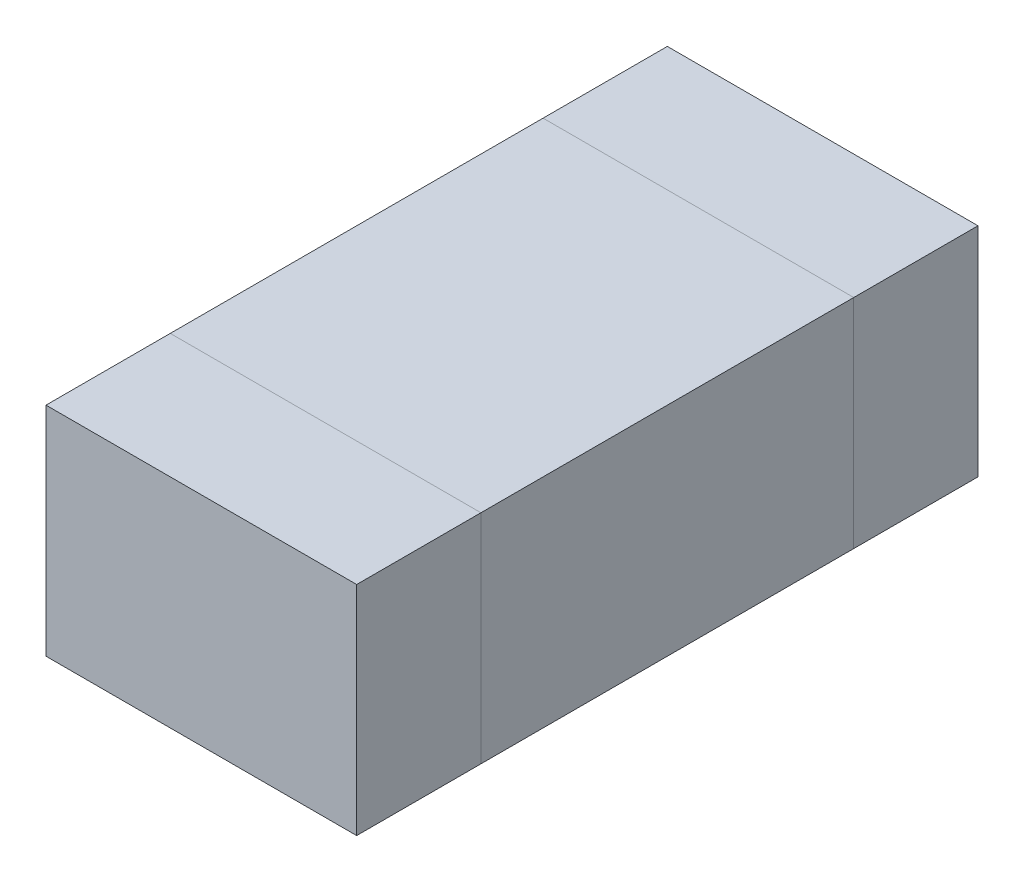
ISO-10303-21;
HEADER;
FILE_DESCRIPTION(('STEP AP214'),'2;1');
FILE_NAME('part.step','',(''),(''),'','','');
FILE_SCHEMA(('AUTOMOTIVE_DESIGN { 1 0 10303 214 1 1 1 1 }'));
ENDSEC;
DATA;
#1=APPLICATION_CONTEXT('core data for automotive mechanical design processes');
#2=APPLICATION_PROTOCOL_DEFINITION('international standard','automotive_design',2000,#1);
#3=PRODUCT_CONTEXT('',#1,'mechanical');
#4=PRODUCT('Part','Part','',(#3));
#5=PRODUCT_RELATED_PRODUCT_CATEGORY('part','',(#4));
#6=PRODUCT_DEFINITION_FORMATION('','',#4);
#7=PRODUCT_DEFINITION_CONTEXT('part definition',#1,'design');
#8=PRODUCT_DEFINITION('design','',#6,#7);
#9=PRODUCT_DEFINITION_SHAPE('','',#8);
#10=(LENGTH_UNIT() NAMED_UNIT(*) SI_UNIT(.MILLI.,.METRE.));
#11=(NAMED_UNIT(*) PLANE_ANGLE_UNIT() SI_UNIT($,.RADIAN.));
#12=(NAMED_UNIT(*) SI_UNIT($,.STERADIAN.) SOLID_ANGLE_UNIT());
#13=UNCERTAINTY_MEASURE_WITH_UNIT(LENGTH_MEASURE(1.E-05),#10,'distance_accuracy_value','');
#14=(GEOMETRIC_REPRESENTATION_CONTEXT(3) GLOBAL_UNCERTAINTY_ASSIGNED_CONTEXT((#13)) GLOBAL_UNIT_ASSIGNED_CONTEXT((#10,
#11,#12)) REPRESENTATION_CONTEXT('',''));
#15=CARTESIAN_POINT('',(0.,0.,0.));
#16=DIRECTION('',(0.,0.,1.));
#17=DIRECTION('',(1.,0.,0.));
#18=AXIS2_PLACEMENT_3D('',#15,#16,#17);
#19=CARTESIAN_POINT('',(0.,0.35,0.));
#20=DIRECTION('',(0.,1.,0.));
#21=DIRECTION('',(0.,0.,1.));
#22=AXIS2_PLACEMENT_3D('',#19,#20,#21);
#23=PLANE('',#22);
#24=DIRECTION('',(0.,0.,-1.));
#25=VECTOR('',#24,1.);
#26=CARTESIAN_POINT('',(-0.25,0.35,-0.3));
#27=LINE('',#26,#25);
#28=CARTESIAN_POINT('',(-0.25,0.35,-0.3));
#29=VERTEX_POINT('',#28);
#30=CARTESIAN_POINT('',(-0.25,0.35,-0.5));
#31=VERTEX_POINT('',#30);
#32=EDGE_CURVE('E58',#29,#31,#27,.T.);
#33=ORIENTED_EDGE('',*,*,#32,.F.);
#34=DIRECTION('',(-1.,0.,0.));
#35=VECTOR('',#34,1.);
#36=CARTESIAN_POINT('',(-0.25,0.35,-0.3));
#37=LINE('',#36,#35);
#38=CARTESIAN_POINT('',(0.25,0.35,-0.3));
#39=VERTEX_POINT('',#38);
#40=EDGE_CURVE('E86',#39,#29,#37,.T.);
#41=ORIENTED_EDGE('',*,*,#40,.F.);
#42=DIRECTION('',(0.,0.,1.));
#43=VECTOR('',#42,1.);
#44=CARTESIAN_POINT('',(0.25,0.35,-0.3));
#45=LINE('',#44,#43);
#46=CARTESIAN_POINT('',(0.25,0.35,-0.5));
#47=VERTEX_POINT('',#46);
#48=EDGE_CURVE('E91',#47,#39,#45,.T.);
#49=ORIENTED_EDGE('',*,*,#48,.F.);
#50=DIRECTION('',(1.,0.,0.));
#51=VECTOR('',#50,1.);
#52=CARTESIAN_POINT('',(-0.25,0.35,-0.5));
#53=LINE('',#52,#51);
#54=EDGE_CURVE('E108',#31,#47,#53,.T.);
#55=ORIENTED_EDGE('',*,*,#54,.F.);
#56=EDGE_LOOP('',(#33,#41,#49,#55));
#57=FACE_BOUND('',#56,.T.);
#58=ADVANCED_FACE('F49',(#57),#23,.T.);
#59=CARTESIAN_POINT('',(0.,0.,0.));
#60=DIRECTION('',(0.,-1.,0.));
#61=DIRECTION('',(0.,0.,-1.));
#62=AXIS2_PLACEMENT_3D('',#59,#60,#61);
#63=PLANE('',#62);
#64=DIRECTION('',(0.,0.,-1.));
#65=VECTOR('',#64,1.);
#66=CARTESIAN_POINT('',(-0.25,0.,-0.3));
#67=LINE('',#66,#65);
#68=CARTESIAN_POINT('',(-0.25,0.,-0.3));
#69=VERTEX_POINT('',#68);
#70=CARTESIAN_POINT('',(-0.25,0.,-0.5));
#71=VERTEX_POINT('',#70);
#72=EDGE_CURVE('E118',#69,#71,#67,.T.);
#73=ORIENTED_EDGE('',*,*,#72,.T.);
#74=DIRECTION('',(1.,0.,0.));
#75=VECTOR('',#74,1.);
#76=CARTESIAN_POINT('',(-0.25,0.,-0.5));
#77=LINE('',#76,#75);
#78=CARTESIAN_POINT('',(0.25,0.,-0.5));
#79=VERTEX_POINT('',#78);
#80=EDGE_CURVE('E106',#71,#79,#77,.T.);
#81=ORIENTED_EDGE('',*,*,#80,.T.);
#82=DIRECTION('',(0.,0.,1.));
#83=VECTOR('',#82,1.);
#84=CARTESIAN_POINT('',(0.25,0.,-0.3));
#85=LINE('',#84,#83);
#86=CARTESIAN_POINT('',(0.25,0.,-0.3));
#87=VERTEX_POINT('',#86);
#88=EDGE_CURVE('E109',#79,#87,#85,.T.);
#89=ORIENTED_EDGE('',*,*,#88,.T.);
#90=DIRECTION('',(-1.,0.,0.));
#91=VECTOR('',#90,1.);
#92=CARTESIAN_POINT('',(-0.25,0.,-0.3));
#93=LINE('',#92,#91);
#94=EDGE_CURVE('E115',#87,#69,#93,.T.);
#95=ORIENTED_EDGE('',*,*,#94,.T.);
#96=EDGE_LOOP('',(#73,#81,#89,#95));
#97=FACE_BOUND('',#96,.T.);
#98=ADVANCED_FACE('F117',(#97),#63,.T.);
#99=CARTESIAN_POINT('',(-0.25,0.888516480713451,-0.5));
#100=DIRECTION('',(0.,0.,-1.));
#101=DIRECTION('',(-1.,0.,0.));
#102=AXIS2_PLACEMENT_3D('',#99,#100,#101);
#103=PLANE('',#102);
#104=DIRECTION('',(0.,-1.,0.));
#105=VECTOR('',#104,1.);
#106=CARTESIAN_POINT('',(-0.25,0.888516480713451,-0.5));
#107=LINE('',#106,#105);
#108=EDGE_CURVE('E12',#31,#71,#107,.T.);
#109=ORIENTED_EDGE('',*,*,#108,.F.);
#110=ORIENTED_EDGE('',*,*,#54,.T.);
#111=DIRECTION('',(0.,-1.,0.));
#112=VECTOR('',#111,1.);
#113=CARTESIAN_POINT('',(0.25,0.888516480713451,-0.5));
#114=LINE('',#113,#112);
#115=EDGE_CURVE('E103',#47,#79,#114,.T.);
#116=ORIENTED_EDGE('',*,*,#115,.T.);
#117=ORIENTED_EDGE('',*,*,#80,.F.);
#118=EDGE_LOOP('',(#109,#110,#116,#117));
#119=FACE_BOUND('',#118,.T.);
#120=ADVANCED_FACE('F104',(#119),#103,.T.);
#121=CARTESIAN_POINT('',(0.25,0.888516480713451,-0.3));
#122=DIRECTION('',(1.,0.,0.));
#123=DIRECTION('',(0.,0.,-1.));
#124=AXIS2_PLACEMENT_3D('',#121,#122,#123);
#125=PLANE('',#124);
#126=ORIENTED_EDGE('',*,*,#115,.F.);
#127=ORIENTED_EDGE('',*,*,#48,.T.);
#128=DIRECTION('',(0.,-1.,0.));
#129=VECTOR('',#128,1.);
#130=CARTESIAN_POINT('',(0.25,0.888516480713451,-0.3));
#131=LINE('',#130,#129);
#132=EDGE_CURVE('E98',#39,#87,#131,.T.);
#133=ORIENTED_EDGE('',*,*,#132,.T.);
#134=ORIENTED_EDGE('',*,*,#88,.F.);
#135=EDGE_LOOP('',(#126,#127,#133,#134));
#136=FACE_BOUND('',#135,.T.);
#137=ADVANCED_FACE('F110',(#136),#125,.T.);
#138=CARTESIAN_POINT('',(-0.25,0.888516480713451,-0.3));
#139=DIRECTION('',(0.,0.,1.));
#140=DIRECTION('',(1.,0.,0.));
#141=AXIS2_PLACEMENT_3D('',#138,#139,#140);
#142=PLANE('',#141);
#143=ORIENTED_EDGE('',*,*,#132,.F.);
#144=ORIENTED_EDGE('',*,*,#40,.T.);
#145=DIRECTION('',(0.,-1.,0.));
#146=VECTOR('',#145,1.);
#147=CARTESIAN_POINT('',(-0.25,0.888516480713451,-0.3));
#148=LINE('',#147,#146);
#149=EDGE_CURVE('E130',#29,#69,#148,.T.);
#150=ORIENTED_EDGE('',*,*,#149,.T.);
#151=ORIENTED_EDGE('',*,*,#94,.F.);
#152=EDGE_LOOP('',(#143,#144,#150,#151));
#153=FACE_BOUND('',#152,.T.);
#154=ADVANCED_FACE('F139',(#153),#142,.T.);
#155=CARTESIAN_POINT('',(-0.25,0.888516480713451,-0.3));
#156=DIRECTION('',(-1.,0.,0.));
#157=DIRECTION('',(0.,0.,1.));
#158=AXIS2_PLACEMENT_3D('',#155,#156,#157);
#159=PLANE('',#158);
#160=ORIENTED_EDGE('',*,*,#149,.F.);
#161=ORIENTED_EDGE('',*,*,#32,.T.);
#162=ORIENTED_EDGE('',*,*,#108,.T.);
#163=ORIENTED_EDGE('',*,*,#72,.F.);
#164=EDGE_LOOP('',(#160,#161,#162,#163));
#165=FACE_BOUND('',#164,.T.);
#166=ADVANCED_FACE('F141',(#165),#159,.T.);
#167=CLOSED_SHELL('',(#58,#98,#120,#137,#154,#166));
#168=MANIFOLD_SOLID_BREP('B2',#167);
#169=CARTESIAN_POINT('',(0.,0.35,0.));
#170=DIRECTION('',(0.,1.,0.));
#171=DIRECTION('',(0.,0.,1.));
#172=AXIS2_PLACEMENT_3D('',#169,#170,#171);
#173=PLANE('',#172);
#174=DIRECTION('',(0.,0.,-1.));
#175=VECTOR('',#174,1.);
#176=CARTESIAN_POINT('',(-0.25,0.35,0.3));
#177=LINE('',#176,#175);
#178=CARTESIAN_POINT('',(-0.25,0.35,0.5));
#179=VERTEX_POINT('',#178);
#180=CARTESIAN_POINT('',(-0.25,0.35,0.3));
#181=VERTEX_POINT('',#180);
#182=EDGE_CURVE('E209',#179,#181,#177,.T.);
#183=ORIENTED_EDGE('',*,*,#182,.F.);
#184=DIRECTION('',(-1.,0.,0.));
#185=VECTOR('',#184,1.);
#186=CARTESIAN_POINT('',(-0.25,0.35,0.5));
#187=LINE('',#186,#185);
#188=CARTESIAN_POINT('',(0.25,0.35,0.5));
#189=VERTEX_POINT('',#188);
#190=EDGE_CURVE('E232',#189,#179,#187,.T.);
#191=ORIENTED_EDGE('',*,*,#190,.F.);
#192=DIRECTION('',(0.,0.,1.));
#193=VECTOR('',#192,1.);
#194=CARTESIAN_POINT('',(0.25,0.35,0.3));
#195=LINE('',#194,#193);
#196=CARTESIAN_POINT('',(0.25,0.35,0.3));
#197=VERTEX_POINT('',#196);
#198=EDGE_CURVE('E237',#197,#189,#195,.T.);
#199=ORIENTED_EDGE('',*,*,#198,.F.);
#200=DIRECTION('',(1.,0.,0.));
#201=VECTOR('',#200,1.);
#202=CARTESIAN_POINT('',(-0.25,0.35,0.3));
#203=LINE('',#202,#201);
#204=EDGE_CURVE('E252',#181,#197,#203,.T.);
#205=ORIENTED_EDGE('',*,*,#204,.F.);
#206=EDGE_LOOP('',(#183,#191,#199,#205));
#207=FACE_BOUND('',#206,.T.);
#208=ADVANCED_FACE('F201',(#207),#173,.T.);
#209=CARTESIAN_POINT('',(0.,0.,0.));
#210=DIRECTION('',(0.,1.,0.));
#211=DIRECTION('',(0.,0.,1.));
#212=AXIS2_PLACEMENT_3D('',#209,#210,#211);
#213=PLANE('',#212);
#214=DIRECTION('',(0.,0.,-1.));
#215=VECTOR('',#214,1.);
#216=CARTESIAN_POINT('',(-0.25,0.,0.3));
#217=LINE('',#216,#215);
#218=CARTESIAN_POINT('',(-0.25,0.,0.5));
#219=VERTEX_POINT('',#218);
#220=CARTESIAN_POINT('',(-0.25,0.,0.3));
#221=VERTEX_POINT('',#220);
#222=EDGE_CURVE('E261',#219,#221,#217,.T.);
#223=ORIENTED_EDGE('',*,*,#222,.T.);
#224=DIRECTION('',(1.,0.,0.));
#225=VECTOR('',#224,1.);
#226=CARTESIAN_POINT('',(-0.25,0.,0.3));
#227=LINE('',#226,#225);
#228=CARTESIAN_POINT('',(0.25,0.,0.3));
#229=VERTEX_POINT('',#228);
#230=EDGE_CURVE('E250',#221,#229,#227,.T.);
#231=ORIENTED_EDGE('',*,*,#230,.T.);
#232=DIRECTION('',(0.,0.,1.));
#233=VECTOR('',#232,1.);
#234=CARTESIAN_POINT('',(0.25,0.,0.3));
#235=LINE('',#234,#233);
#236=CARTESIAN_POINT('',(0.25,0.,0.5));
#237=VERTEX_POINT('',#236);
#238=EDGE_CURVE('E253',#229,#237,#235,.T.);
#239=ORIENTED_EDGE('',*,*,#238,.T.);
#240=DIRECTION('',(-1.,0.,0.));
#241=VECTOR('',#240,1.);
#242=CARTESIAN_POINT('',(-0.25,0.,0.5));
#243=LINE('',#242,#241);
#244=EDGE_CURVE('E258',#237,#219,#243,.T.);
#245=ORIENTED_EDGE('',*,*,#244,.T.);
#246=EDGE_LOOP('',(#223,#231,#239,#245));
#247=FACE_BOUND('',#246,.T.);
#248=ADVANCED_FACE('F260',(#247),#213,.F.);
#249=CARTESIAN_POINT('',(-0.25,0.88851648071345,0.3));
#250=DIRECTION('',(0.,0.,-1.));
#251=DIRECTION('',(-1.,0.,0.));
#252=AXIS2_PLACEMENT_3D('',#249,#250,#251);
#253=PLANE('',#252);
#254=DIRECTION('',(0.,-1.,0.));
#255=VECTOR('',#254,1.);
#256=CARTESIAN_POINT('',(-0.25,0.88851648071345,0.3));
#257=LINE('',#256,#255);
#258=EDGE_CURVE('E47',#181,#221,#257,.T.);
#259=ORIENTED_EDGE('',*,*,#258,.F.);
#260=ORIENTED_EDGE('',*,*,#204,.T.);
#261=DIRECTION('',(0.,-1.,0.));
#262=VECTOR('',#261,1.);
#263=CARTESIAN_POINT('',(0.25,0.88851648071345,0.3));
#264=LINE('',#263,#262);
#265=EDGE_CURVE('E247',#197,#229,#264,.T.);
#266=ORIENTED_EDGE('',*,*,#265,.T.);
#267=ORIENTED_EDGE('',*,*,#230,.F.);
#268=EDGE_LOOP('',(#259,#260,#266,#267));
#269=FACE_BOUND('',#268,.T.);
#270=ADVANCED_FACE('F248',(#269),#253,.T.);
#271=CARTESIAN_POINT('',(0.25,0.88851648071345,0.3));
#272=DIRECTION('',(1.,0.,0.));
#273=DIRECTION('',(0.,0.,-1.));
#274=AXIS2_PLACEMENT_3D('',#271,#272,#273);
#275=PLANE('',#274);
#276=ORIENTED_EDGE('',*,*,#265,.F.);
#277=ORIENTED_EDGE('',*,*,#198,.T.);
#278=DIRECTION('',(0.,-1.,0.));
#279=VECTOR('',#278,1.);
#280=CARTESIAN_POINT('',(0.25,0.88851648071345,0.5));
#281=LINE('',#280,#279);
#282=EDGE_CURVE('E242',#189,#237,#281,.T.);
#283=ORIENTED_EDGE('',*,*,#282,.T.);
#284=ORIENTED_EDGE('',*,*,#238,.F.);
#285=EDGE_LOOP('',(#276,#277,#283,#284));
#286=FACE_BOUND('',#285,.T.);
#287=ADVANCED_FACE('F254',(#286),#275,.T.);
#288=CARTESIAN_POINT('',(-0.25,0.88851648071345,0.5));
#289=DIRECTION('',(0.,0.,1.));
#290=DIRECTION('',(1.,0.,0.));
#291=AXIS2_PLACEMENT_3D('',#288,#289,#290);
#292=PLANE('',#291);
#293=ORIENTED_EDGE('',*,*,#282,.F.);
#294=ORIENTED_EDGE('',*,*,#190,.T.);
#295=DIRECTION('',(0.,-1.,0.));
#296=VECTOR('',#295,1.);
#297=CARTESIAN_POINT('',(-0.25,0.88851648071345,0.5));
#298=LINE('',#297,#296);
#299=EDGE_CURVE('E268',#179,#219,#298,.T.);
#300=ORIENTED_EDGE('',*,*,#299,.T.);
#301=ORIENTED_EDGE('',*,*,#244,.F.);
#302=EDGE_LOOP('',(#293,#294,#300,#301));
#303=FACE_BOUND('',#302,.T.);
#304=ADVANCED_FACE('F274',(#303),#292,.T.);
#305=CARTESIAN_POINT('',(-0.25,0.88851648071345,0.3));
#306=DIRECTION('',(-1.,0.,0.));
#307=DIRECTION('',(0.,0.,1.));
#308=AXIS2_PLACEMENT_3D('',#305,#306,#307);
#309=PLANE('',#308);
#310=ORIENTED_EDGE('',*,*,#299,.F.);
#311=ORIENTED_EDGE('',*,*,#182,.T.);
#312=ORIENTED_EDGE('',*,*,#258,.T.);
#313=ORIENTED_EDGE('',*,*,#222,.F.);
#314=EDGE_LOOP('',(#310,#311,#312,#313));
#315=FACE_BOUND('',#314,.T.);
#316=ADVANCED_FACE('F275',(#315),#309,.T.);
#317=CLOSED_SHELL('',(#208,#248,#270,#287,#304,#316));
#318=MANIFOLD_SOLID_BREP('B6',#317);
#319=CARTESIAN_POINT('',(0.25,0.35,-0.3));
#320=DIRECTION('',(-1.,0.,0.));
#321=DIRECTION('',(0.,0.,1.));
#322=AXIS2_PLACEMENT_3D('',#319,#320,#321);
#323=PLANE('',#322);
#324=DIRECTION('',(0.,0.,-1.));
#325=VECTOR('',#324,1.);
#326=CARTESIAN_POINT('',(0.25,0.,-0.3));
#327=LINE('',#326,#325);
#328=CARTESIAN_POINT('',(0.25,0.,0.3));
#329=VERTEX_POINT('',#328);
#330=CARTESIAN_POINT('',(0.25,0.,-0.3));
#331=VERTEX_POINT('',#330);
#332=EDGE_CURVE('E401',#329,#331,#327,.T.);
#333=ORIENTED_EDGE('',*,*,#332,.T.);
#334=DIRECTION('',(0.,-1.,0.));
#335=VECTOR('',#334,1.);
#336=CARTESIAN_POINT('',(0.25,0.35,-0.3));
#337=LINE('',#336,#335);
#338=CARTESIAN_POINT('',(0.25,0.35,-0.3));
#339=VERTEX_POINT('',#338);
#340=EDGE_CURVE('E199',#339,#331,#337,.T.);
#341=ORIENTED_EDGE('',*,*,#340,.F.);
#342=DIRECTION('',(0.,0.,-1.));
#343=VECTOR('',#342,1.);
#344=CARTESIAN_POINT('',(0.25,0.35,-0.3));
#345=LINE('',#344,#343);
#346=CARTESIAN_POINT('',(0.25,0.35,0.3));
#347=VERTEX_POINT('',#346);
#348=EDGE_CURVE('E384',#347,#339,#345,.T.);
#349=ORIENTED_EDGE('',*,*,#348,.F.);
#350=DIRECTION('',(0.,-1.,0.));
#351=VECTOR('',#350,1.);
#352=CARTESIAN_POINT('',(0.25,0.35,0.3));
#353=LINE('',#352,#351);
#354=EDGE_CURVE('E397',#347,#329,#353,.T.);
#355=ORIENTED_EDGE('',*,*,#354,.T.);
#356=EDGE_LOOP('',(#333,#341,#349,#355));
#357=FACE_BOUND('',#356,.T.);
#358=ADVANCED_FACE('F324',(#357),#323,.F.);
#359=CARTESIAN_POINT('',(-0.25,0.35,-0.3));
#360=DIRECTION('',(0.,0.,1.));
#361=DIRECTION('',(1.,0.,0.));
#362=AXIS2_PLACEMENT_3D('',#359,#360,#361);
#363=PLANE('',#362);
#364=DIRECTION('',(-1.,0.,0.));
#365=VECTOR('',#364,1.);
#366=CARTESIAN_POINT('',(-0.25,0.,-0.3));
#367=LINE('',#366,#365);
#368=CARTESIAN_POINT('',(-0.25,0.,-0.3));
#369=VERTEX_POINT('',#368);
#370=EDGE_CURVE('E389',#331,#369,#367,.T.);
#371=ORIENTED_EDGE('',*,*,#370,.T.);
#372=DIRECTION('',(0.,-1.,0.));
#373=VECTOR('',#372,1.);
#374=CARTESIAN_POINT('',(-0.25,0.35,-0.3));
#375=LINE('',#374,#373);
#376=CARTESIAN_POINT('',(-0.25,0.35,-0.3));
#377=VERTEX_POINT('',#376);
#378=EDGE_CURVE('E333',#377,#369,#375,.T.);
#379=ORIENTED_EDGE('',*,*,#378,.F.);
#380=DIRECTION('',(-1.,0.,0.));
#381=VECTOR('',#380,1.);
#382=CARTESIAN_POINT('',(-0.25,0.35,-0.3));
#383=LINE('',#382,#381);
#384=EDGE_CURVE('E379',#339,#377,#383,.T.);
#385=ORIENTED_EDGE('',*,*,#384,.F.);
#386=ORIENTED_EDGE('',*,*,#340,.T.);
#387=EDGE_LOOP('',(#371,#379,#385,#386));
#388=FACE_BOUND('',#387,.T.);
#389=ADVANCED_FACE('F388',(#388),#363,.F.);
#390=CARTESIAN_POINT('',(-0.25,0.35,-0.3));
#391=DIRECTION('',(1.,0.,0.));
#392=DIRECTION('',(0.,0.,-1.));
#393=AXIS2_PLACEMENT_3D('',#390,#391,#392);
#394=PLANE('',#393);
#395=DIRECTION('',(0.,0.,1.));
#396=VECTOR('',#395,1.);
#397=CARTESIAN_POINT('',(-0.25,0.,-0.3));
#398=LINE('',#397,#396);
#399=CARTESIAN_POINT('',(-0.25,0.,0.3));
#400=VERTEX_POINT('',#399);
#401=EDGE_CURVE('E364',#369,#400,#398,.T.);
#402=ORIENTED_EDGE('',*,*,#401,.T.);
#403=DIRECTION('',(0.,-1.,0.));
#404=VECTOR('',#403,1.);
#405=CARTESIAN_POINT('',(-0.25,0.35,0.3));
#406=LINE('',#405,#404);
#407=CARTESIAN_POINT('',(-0.25,0.35,0.3));
#408=VERTEX_POINT('',#407);
#409=EDGE_CURVE('E391',#408,#400,#406,.T.);
#410=ORIENTED_EDGE('',*,*,#409,.F.);
#411=DIRECTION('',(0.,0.,1.));
#412=VECTOR('',#411,1.);
#413=CARTESIAN_POINT('',(-0.25,0.35,-0.3));
#414=LINE('',#413,#412);
#415=EDGE_CURVE('E382',#377,#408,#414,.T.);
#416=ORIENTED_EDGE('',*,*,#415,.F.);
#417=ORIENTED_EDGE('',*,*,#378,.T.);
#418=EDGE_LOOP('',(#402,#410,#416,#417));
#419=FACE_BOUND('',#418,.T.);
#420=ADVANCED_FACE('F392',(#419),#394,.F.);
#421=CARTESIAN_POINT('',(-0.25,0.35,0.3));
#422=DIRECTION('',(0.,0.,-1.));
#423=DIRECTION('',(-1.,0.,0.));
#424=AXIS2_PLACEMENT_3D('',#421,#422,#423);
#425=PLANE('',#424);
#426=DIRECTION('',(1.,0.,0.));
#427=VECTOR('',#426,1.);
#428=CARTESIAN_POINT('',(-0.25,0.,0.3));
#429=LINE('',#428,#427);
#430=EDGE_CURVE('E372',#400,#329,#429,.T.);
#431=ORIENTED_EDGE('',*,*,#430,.T.);
#432=ORIENTED_EDGE('',*,*,#354,.F.);
#433=DIRECTION('',(1.,0.,0.));
#434=VECTOR('',#433,1.);
#435=CARTESIAN_POINT('',(-0.25,0.35,0.3));
#436=LINE('',#435,#434);
#437=EDGE_CURVE('E343',#408,#347,#436,.T.);
#438=ORIENTED_EDGE('',*,*,#437,.F.);
#439=ORIENTED_EDGE('',*,*,#409,.T.);
#440=EDGE_LOOP('',(#431,#432,#438,#439));
#441=FACE_BOUND('',#440,.T.);
#442=ADVANCED_FACE('F413',(#441),#425,.F.);
#443=CARTESIAN_POINT('',(0.,0.35,0.));
#444=DIRECTION('',(0.,1.,0.));
#445=DIRECTION('',(0.,0.,1.));
#446=AXIS2_PLACEMENT_3D('',#443,#444,#445);
#447=PLANE('',#446);
#448=ORIENTED_EDGE('',*,*,#348,.T.);
#449=ORIENTED_EDGE('',*,*,#384,.T.);
#450=ORIENTED_EDGE('',*,*,#415,.T.);
#451=ORIENTED_EDGE('',*,*,#437,.T.);
#452=EDGE_LOOP('',(#448,#449,#450,#451));
#453=FACE_BOUND('',#452,.T.);
#454=ADVANCED_FACE('F380',(#453),#447,.T.);
#455=CARTESIAN_POINT('',(0.,0.,0.));
#456=DIRECTION('',(0.,1.,0.));
#457=DIRECTION('',(0.,0.,1.));
#458=AXIS2_PLACEMENT_3D('',#455,#456,#457);
#459=PLANE('',#458);
#460=ORIENTED_EDGE('',*,*,#332,.F.);
#461=ORIENTED_EDGE('',*,*,#430,.F.);
#462=ORIENTED_EDGE('',*,*,#401,.F.);
#463=ORIENTED_EDGE('',*,*,#370,.F.);
#464=EDGE_LOOP('',(#460,#461,#462,#463));
#465=FACE_BOUND('',#464,.T.);
#466=ADVANCED_FACE('F416',(#465),#459,.F.);
#467=CLOSED_SHELL('',(#358,#389,#420,#442,#454,#466));
#468=MANIFOLD_SOLID_BREP('B41',#467);
#469=ADVANCED_BREP_SHAPE_REPRESENTATION('',(#18,#168,#318,#468),#14);
#470=SHAPE_DEFINITION_REPRESENTATION(#9,#469);
ENDSEC;
END-ISO-10303-21;
